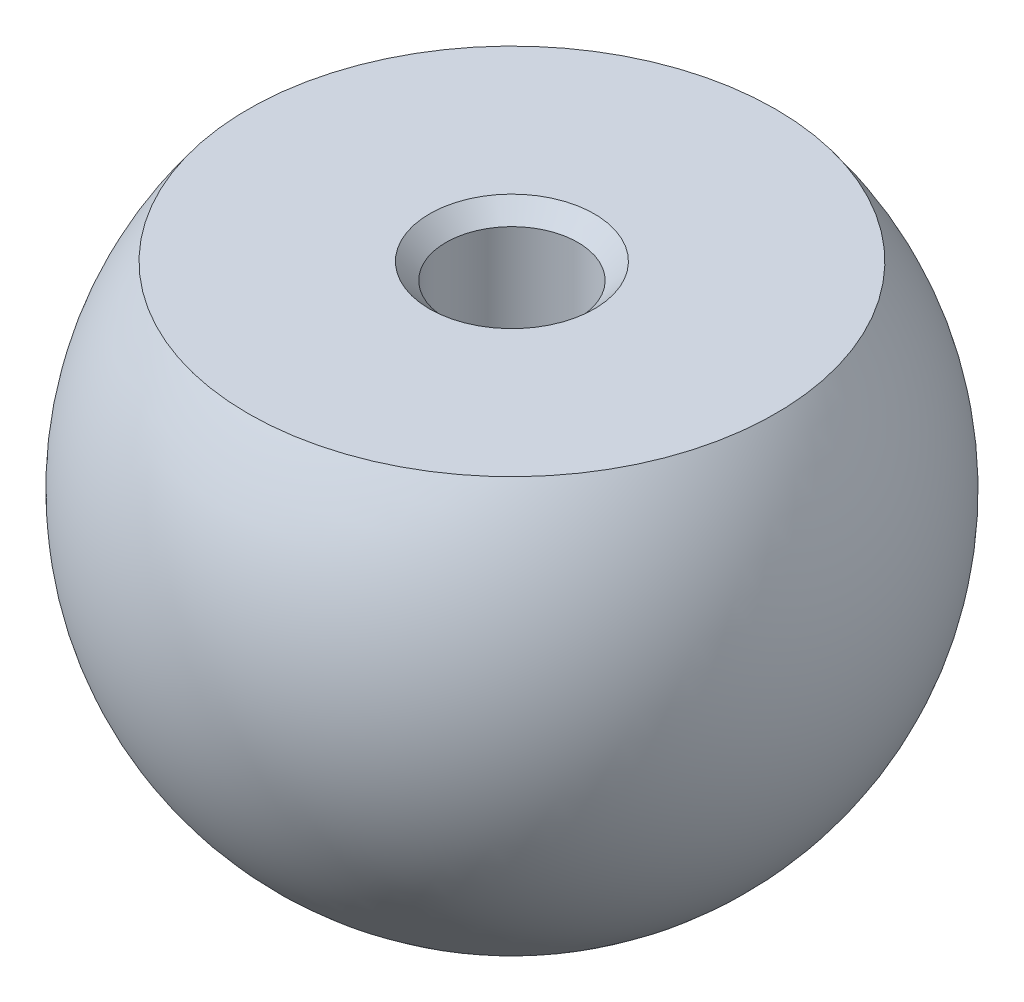
ISO-10303-21;
HEADER;
FILE_DESCRIPTION(('STEP AP214'),'2;1');
FILE_NAME('part.step','',(''),(''),'','','');
FILE_SCHEMA(('AUTOMOTIVE_DESIGN { 1 0 10303 214 1 1 1 1 }'));
ENDSEC;
DATA;
#1=APPLICATION_CONTEXT('core data for automotive mechanical design processes');
#2=APPLICATION_PROTOCOL_DEFINITION('international standard','automotive_design',2000,#1);
#3=PRODUCT_CONTEXT('',#1,'mechanical');
#4=PRODUCT('Part','Part','',(#3));
#5=PRODUCT_RELATED_PRODUCT_CATEGORY('part','',(#4));
#6=PRODUCT_DEFINITION_FORMATION('','',#4);
#7=PRODUCT_DEFINITION_CONTEXT('part definition',#1,'design');
#8=PRODUCT_DEFINITION('design','',#6,#7);
#9=PRODUCT_DEFINITION_SHAPE('','',#8);
#10=(LENGTH_UNIT() NAMED_UNIT(*) SI_UNIT(.MILLI.,.METRE.));
#11=(NAMED_UNIT(*) PLANE_ANGLE_UNIT() SI_UNIT($,.RADIAN.));
#12=(NAMED_UNIT(*) SI_UNIT($,.STERADIAN.) SOLID_ANGLE_UNIT());
#13=UNCERTAINTY_MEASURE_WITH_UNIT(LENGTH_MEASURE(1.E-05),#10,'distance_accuracy_value','');
#14=(GEOMETRIC_REPRESENTATION_CONTEXT(3) GLOBAL_UNCERTAINTY_ASSIGNED_CONTEXT((#13)) GLOBAL_UNIT_ASSIGNED_CONTEXT((#10,
#11,#12)) REPRESENTATION_CONTEXT('',''));
#15=CARTESIAN_POINT('',(0.,0.,0.));
#16=DIRECTION('',(0.,0.,1.));
#17=DIRECTION('',(1.,0.,0.));
#18=AXIS2_PLACEMENT_3D('',#15,#16,#17);
#19=CARTESIAN_POINT('',(0.,0.,0.));
#20=DIRECTION('',(0.,-1.,0.));
#21=DIRECTION('',(0.,0.,1.));
#22=AXIS2_PLACEMENT_3D('',#19,#20,#21);
#23=SPHERICAL_SURFACE('',#22,20.);
#24=CARTESIAN_POINT('',(0.,12.,0.));
#25=DIRECTION('',(0.,-1.,0.));
#26=DIRECTION('',(0.,0.,-1.));
#27=AXIS2_PLACEMENT_3D('',#24,#25,#26);
#28=CIRCLE('',#27,16.);
#29=CARTESIAN_POINT('',(0.,12.,-16.));
#30=VERTEX_POINT('',#29);
#31=EDGE_CURVE('E60',#30,#30,#28,.T.);
#32=ORIENTED_EDGE('',*,*,#31,.T.);
#33=EDGE_LOOP('',(#32));
#34=FACE_BOUND('',#33,.T.);
#35=ADVANCED_FACE('F39',(#34),#23,.T.);
#36=CARTESIAN_POINT('',(0.,12.,0.));
#37=DIRECTION('',(0.,1.,0.));
#38=DIRECTION('',(0.,0.,1.));
#39=AXIS2_PLACEMENT_3D('',#36,#37,#38);
#40=PLANE('',#39);
#41=CARTESIAN_POINT('',(0.,12.,0.));
#42=DIRECTION('',(0.,1.,0.));
#43=DIRECTION('',(0.,0.,1.));
#44=AXIS2_PLACEMENT_3D('',#41,#42,#43);
#45=CIRCLE('',#44,5.00000000000002);
#46=CARTESIAN_POINT('',(0.,12.,5.00000000000002));
#47=VERTEX_POINT('',#46);
#48=EDGE_CURVE('E10',#47,#47,#45,.F.);
#49=ORIENTED_EDGE('',*,*,#48,.T.);
#50=EDGE_LOOP('',(#49));
#51=FACE_BOUND('',#50,.T.);
#52=ORIENTED_EDGE('',*,*,#31,.F.);
#53=EDGE_LOOP('',(#52));
#54=FACE_BOUND('',#53,.T.);
#55=ADVANCED_FACE('F65',(#51,#54),#40,.T.);
#56=CARTESIAN_POINT('',(0.,-8.,0.));
#57=DIRECTION('',(0.,1.,0.));
#58=DIRECTION('',(0.,0.,1.));
#59=AXIS2_PLACEMENT_3D('',#56,#57,#58);
#60=CYLINDRICAL_SURFACE('',#59,4.);
#61=CARTESIAN_POINT('',(0.,11.,0.));
#62=DIRECTION('',(0.,1.,0.));
#63=DIRECTION('',(0.,0.,1.));
#64=AXIS2_PLACEMENT_3D('',#61,#62,#63);
#65=CIRCLE('',#64,4.);
#66=CARTESIAN_POINT('',(0.,11.,4.));
#67=VERTEX_POINT('',#66);
#68=EDGE_CURVE('E47',#67,#67,#65,.T.);
#69=ORIENTED_EDGE('',*,*,#68,.T.);
#70=EDGE_LOOP('',(#69));
#71=FACE_BOUND('',#70,.T.);
#72=CARTESIAN_POINT('',(0.,2.00000000000868,0.));
#73=DIRECTION('',(0.,1.,0.));
#74=DIRECTION('',(0.,0.,1.));
#75=AXIS2_PLACEMENT_3D('',#72,#73,#74);
#76=CIRCLE('',#75,4.);
#77=CARTESIAN_POINT('',(0.,2.00000000000868,4.));
#78=VERTEX_POINT('',#77);
#79=EDGE_CURVE('E51',#78,#78,#76,.F.);
#80=ORIENTED_EDGE('',*,*,#79,.T.);
#81=EDGE_LOOP('',(#80));
#82=FACE_BOUND('',#81,.T.);
#83=ADVANCED_FACE('F67',(#71,#82),#60,.F.);
#84=CARTESIAN_POINT('',(0.,-8.,0.));
#85=DIRECTION('',(0.,1.,0.));
#86=DIRECTION('',(0.,0.,1.));
#87=AXIS2_PLACEMENT_3D('',#84,#85,#86);
#88=PLANE('',#87);
#89=CARTESIAN_POINT('',(0.,-8.,0.));
#90=DIRECTION('',(0.,1.,0.));
#91=DIRECTION('',(0.,0.,1.));
#92=AXIS2_PLACEMENT_3D('',#89,#90,#91);
#93=CIRCLE('',#92,3.82544935071764);
#94=CARTESIAN_POINT('',(0.,-8.,3.82544935071764));
#95=VERTEX_POINT('',#94);
#96=EDGE_CURVE('E55',#95,#95,#93,.T.);
#97=ORIENTED_EDGE('',*,*,#96,.T.);
#98=EDGE_LOOP('',(#97));
#99=FACE_BOUND('',#98,.T.);
#100=ADVANCED_FACE('F73',(#99),#88,.T.);
#101=CARTESIAN_POINT('',(0.,-8.,0.));
#102=DIRECTION('',(0.,1.,0.));
#103=DIRECTION('',(0.,0.,1.));
#104=AXIS2_PLACEMENT_3D('',#101,#102,#103);
#105=CONICAL_SURFACE('',#104,3.82544935071764,0.0174532925199468);
#106=ORIENTED_EDGE('',*,*,#79,.F.);
#107=EDGE_LOOP('',(#106));
#108=FACE_BOUND('',#107,.T.);
#109=ORIENTED_EDGE('',*,*,#96,.F.);
#110=EDGE_LOOP('',(#109));
#111=FACE_BOUND('',#110,.T.);
#112=ADVANCED_FACE('F78',(#108,#111),#105,.F.);
#113=CARTESIAN_POINT('',(0.,11.,0.));
#114=DIRECTION('',(0.,1.,0.));
#115=DIRECTION('',(0.,0.,1.));
#116=AXIS2_PLACEMENT_3D('',#113,#114,#115);
#117=CONICAL_SURFACE('',#116,4.,0.785398163397448);
#118=ORIENTED_EDGE('',*,*,#48,.F.);
#119=EDGE_LOOP('',(#118));
#120=FACE_BOUND('',#119,.T.);
#121=ORIENTED_EDGE('',*,*,#68,.F.);
#122=EDGE_LOOP('',(#121));
#123=FACE_BOUND('',#122,.T.);
#124=ADVANCED_FACE('F42',(#120,#123),#117,.F.);
#125=CLOSED_SHELL('',(#35,#55,#83,#100,#112,#124));
#126=MANIFOLD_SOLID_BREP('B2',#125);
#127=ADVANCED_BREP_SHAPE_REPRESENTATION('',(#18,#126),#14);
#128=SHAPE_DEFINITION_REPRESENTATION(#9,#127);
ENDSEC;
END-ISO-10303-21;
